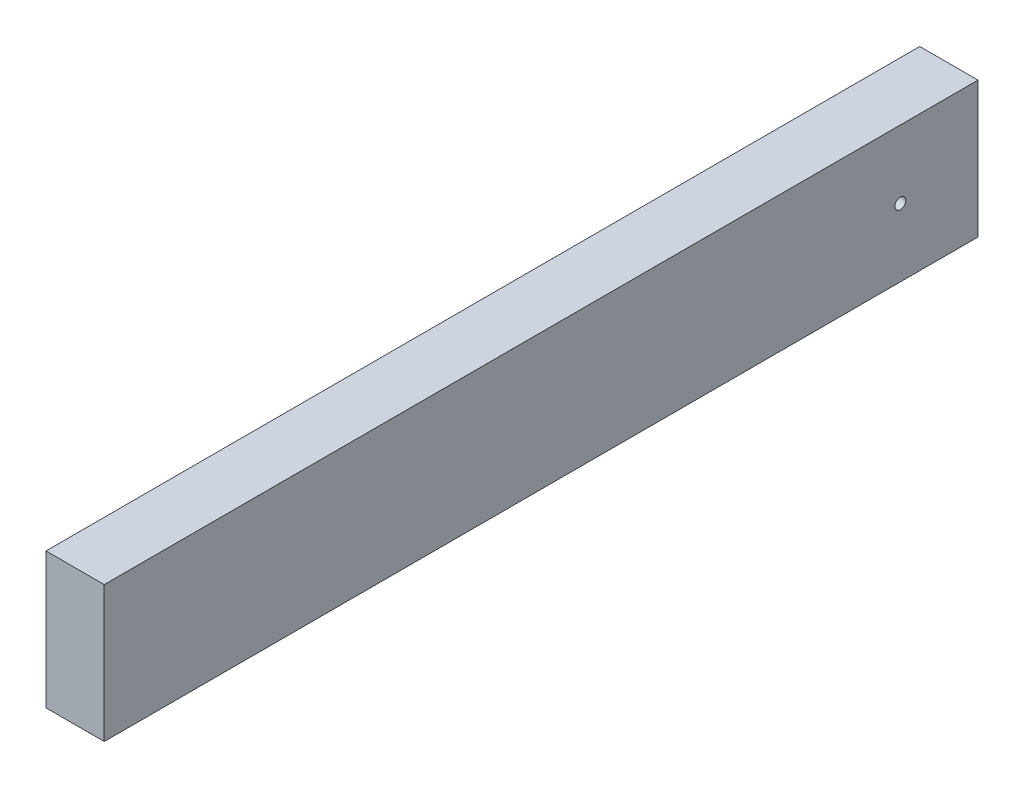
ISO-10303-21;
HEADER;
FILE_DESCRIPTION(('STEP AP214'),'2;1');
FILE_NAME('part.step','',(''),(''),'','','');
FILE_SCHEMA(('AUTOMOTIVE_DESIGN { 1 0 10303 214 1 1 1 1 }'));
ENDSEC;
DATA;
#1=APPLICATION_CONTEXT('core data for automotive mechanical design processes');
#2=APPLICATION_PROTOCOL_DEFINITION('international standard','automotive_design',2000,#1);
#3=PRODUCT_CONTEXT('',#1,'mechanical');
#4=PRODUCT('Part','Part','',(#3));
#5=PRODUCT_RELATED_PRODUCT_CATEGORY('part','',(#4));
#6=PRODUCT_DEFINITION_FORMATION('','',#4);
#7=PRODUCT_DEFINITION_CONTEXT('part definition',#1,'design');
#8=PRODUCT_DEFINITION('design','',#6,#7);
#9=PRODUCT_DEFINITION_SHAPE('','',#8);
#10=(LENGTH_UNIT() NAMED_UNIT(*) SI_UNIT(.MILLI.,.METRE.));
#11=(NAMED_UNIT(*) PLANE_ANGLE_UNIT() SI_UNIT($,.RADIAN.));
#12=(NAMED_UNIT(*) SI_UNIT($,.STERADIAN.) SOLID_ANGLE_UNIT());
#13=UNCERTAINTY_MEASURE_WITH_UNIT(LENGTH_MEASURE(1.E-05),#10,'distance_accuracy_value','');
#14=(GEOMETRIC_REPRESENTATION_CONTEXT(3) GLOBAL_UNCERTAINTY_ASSIGNED_CONTEXT((#13)) GLOBAL_UNIT_ASSIGNED_CONTEXT((#10,
#11,#12)) REPRESENTATION_CONTEXT('',''));
#15=CARTESIAN_POINT('',(0.,0.,0.));
#16=DIRECTION('',(0.,0.,1.));
#17=DIRECTION('',(1.,0.,0.));
#18=AXIS2_PLACEMENT_3D('',#15,#16,#17);
#19=CARTESIAN_POINT('',(19.05,-44.45,571.5));
#20=DIRECTION('',(-1.,0.,0.));
#21=DIRECTION('',(0.,0.,1.));
#22=AXIS2_PLACEMENT_3D('',#19,#20,#21);
#23=PLANE('',#22);
#24=CARTESIAN_POINT('',(19.05,0.,50.8));
#25=DIRECTION('',(1.,0.,0.));
#26=DIRECTION('',(0.,0.,-1.));
#27=AXIS2_PLACEMENT_3D('',#24,#25,#26);
#28=CIRCLE('',#27,3.571875);
#29=CARTESIAN_POINT('',(19.05,0.,47.228125));
#30=VERTEX_POINT('',#29);
#31=EDGE_CURVE('E131',#30,#30,#28,.T.);
#32=ORIENTED_EDGE('',*,*,#31,.F.);
#33=EDGE_LOOP('',(#32));
#34=FACE_BOUND('',#33,.T.);
#35=DIRECTION('',(0.,1.,0.));
#36=VECTOR('',#35,1.);
#37=CARTESIAN_POINT('',(19.05,-44.45,0.));
#38=LINE('',#37,#36);
#39=CARTESIAN_POINT('',(19.05,-44.45,0.));
#40=VERTEX_POINT('',#39);
#41=CARTESIAN_POINT('',(19.05,44.45,0.));
#42=VERTEX_POINT('',#41);
#43=EDGE_CURVE('E105',#40,#42,#38,.T.);
#44=ORIENTED_EDGE('',*,*,#43,.T.);
#45=DIRECTION('',(0.,0.,-1.));
#46=VECTOR('',#45,1.);
#47=CARTESIAN_POINT('',(19.05,44.45,571.5));
#48=LINE('',#47,#46);
#49=CARTESIAN_POINT('',(19.05,44.45,571.5));
#50=VERTEX_POINT('',#49);
#51=EDGE_CURVE('E11',#50,#42,#48,.T.);
#52=ORIENTED_EDGE('',*,*,#51,.F.);
#53=DIRECTION('',(0.,1.,0.));
#54=VECTOR('',#53,1.);
#55=CARTESIAN_POINT('',(19.05,-44.45,571.5));
#56=LINE('',#55,#54);
#57=CARTESIAN_POINT('',(19.05,-44.45,571.5));
#58=VERTEX_POINT('',#57);
#59=EDGE_CURVE('E88',#58,#50,#56,.T.);
#60=ORIENTED_EDGE('',*,*,#59,.F.);
#61=DIRECTION('',(0.,0.,-1.));
#62=VECTOR('',#61,1.);
#63=CARTESIAN_POINT('',(19.05,-44.45,571.5));
#64=LINE('',#63,#62);
#65=EDGE_CURVE('E101',#58,#40,#64,.T.);
#66=ORIENTED_EDGE('',*,*,#65,.T.);
#67=EDGE_LOOP('',(#44,#52,#60,#66));
#68=FACE_BOUND('',#67,.T.);
#69=ADVANCED_FACE('F36',(#34,#68),#23,.F.);
#70=CARTESIAN_POINT('',(-19.05,44.45,571.5));
#71=DIRECTION('',(0.,-1.,0.));
#72=DIRECTION('',(0.,0.,-1.));
#73=AXIS2_PLACEMENT_3D('',#70,#71,#72);
#74=PLANE('',#73);
#75=DIRECTION('',(-1.,0.,0.));
#76=VECTOR('',#75,1.);
#77=CARTESIAN_POINT('',(-19.05,44.45,0.));
#78=LINE('',#77,#76);
#79=CARTESIAN_POINT('',(-19.05,44.45,0.));
#80=VERTEX_POINT('',#79);
#81=EDGE_CURVE('E93',#42,#80,#78,.T.);
#82=ORIENTED_EDGE('',*,*,#81,.T.);
#83=DIRECTION('',(0.,0.,-1.));
#84=VECTOR('',#83,1.);
#85=CARTESIAN_POINT('',(-19.05,44.45,571.5));
#86=LINE('',#85,#84);
#87=CARTESIAN_POINT('',(-19.05,44.45,571.5));
#88=VERTEX_POINT('',#87);
#89=EDGE_CURVE('E45',#88,#80,#86,.T.);
#90=ORIENTED_EDGE('',*,*,#89,.F.);
#91=DIRECTION('',(-1.,0.,0.));
#92=VECTOR('',#91,1.);
#93=CARTESIAN_POINT('',(-19.05,44.45,571.5));
#94=LINE('',#93,#92);
#95=EDGE_CURVE('E83',#50,#88,#94,.T.);
#96=ORIENTED_EDGE('',*,*,#95,.F.);
#97=ORIENTED_EDGE('',*,*,#51,.T.);
#98=EDGE_LOOP('',(#82,#90,#96,#97));
#99=FACE_BOUND('',#98,.T.);
#100=ADVANCED_FACE('F92',(#99),#74,.F.);
#101=CARTESIAN_POINT('',(-19.05,-44.45,571.5));
#102=DIRECTION('',(1.,0.,0.));
#103=DIRECTION('',(0.,0.,-1.));
#104=AXIS2_PLACEMENT_3D('',#101,#102,#103);
#105=PLANE('',#104);
#106=CARTESIAN_POINT('',(-19.05,0.,50.8));
#107=DIRECTION('',(1.,0.,0.));
#108=DIRECTION('',(0.,0.,-1.));
#109=AXIS2_PLACEMENT_3D('',#106,#107,#108);
#110=CIRCLE('',#109,3.57187499999999);
#111=CARTESIAN_POINT('',(-19.05,0.,47.228125));
#112=VERTEX_POINT('',#111);
#113=EDGE_CURVE('E109',#112,#112,#110,.T.);
#114=ORIENTED_EDGE('',*,*,#113,.T.);
#115=EDGE_LOOP('',(#114));
#116=FACE_BOUND('',#115,.T.);
#117=DIRECTION('',(0.,-1.,0.));
#118=VECTOR('',#117,1.);
#119=CARTESIAN_POINT('',(-19.05,-44.45,0.));
#120=LINE('',#119,#118);
#121=CARTESIAN_POINT('',(-19.05,-44.45,0.));
#122=VERTEX_POINT('',#121);
#123=EDGE_CURVE('E70',#80,#122,#120,.T.);
#124=ORIENTED_EDGE('',*,*,#123,.T.);
#125=DIRECTION('',(0.,0.,-1.));
#126=VECTOR('',#125,1.);
#127=CARTESIAN_POINT('',(-19.05,-44.45,571.5));
#128=LINE('',#127,#126);
#129=CARTESIAN_POINT('',(-19.05,-44.45,571.5));
#130=VERTEX_POINT('',#129);
#131=EDGE_CURVE('E95',#130,#122,#128,.T.);
#132=ORIENTED_EDGE('',*,*,#131,.F.);
#133=DIRECTION('',(0.,-1.,0.));
#134=VECTOR('',#133,1.);
#135=CARTESIAN_POINT('',(-19.05,-44.45,571.5));
#136=LINE('',#135,#134);
#137=EDGE_CURVE('E86',#88,#130,#136,.T.);
#138=ORIENTED_EDGE('',*,*,#137,.F.);
#139=ORIENTED_EDGE('',*,*,#89,.T.);
#140=EDGE_LOOP('',(#124,#132,#138,#139));
#141=FACE_BOUND('',#140,.T.);
#142=ADVANCED_FACE('F96',(#116,#141),#105,.F.);
#143=CARTESIAN_POINT('',(-19.05,-44.45,571.5));
#144=DIRECTION('',(0.,1.,0.));
#145=DIRECTION('',(0.,0.,1.));
#146=AXIS2_PLACEMENT_3D('',#143,#144,#145);
#147=PLANE('',#146);
#148=DIRECTION('',(1.,0.,0.));
#149=VECTOR('',#148,1.);
#150=CARTESIAN_POINT('',(-19.05,-44.45,0.));
#151=LINE('',#150,#149);
#152=EDGE_CURVE('E76',#122,#40,#151,.T.);
#153=ORIENTED_EDGE('',*,*,#152,.T.);
#154=ORIENTED_EDGE('',*,*,#65,.F.);
#155=DIRECTION('',(1.,0.,0.));
#156=VECTOR('',#155,1.);
#157=CARTESIAN_POINT('',(-19.05,-44.45,571.5));
#158=LINE('',#157,#156);
#159=EDGE_CURVE('E53',#130,#58,#158,.T.);
#160=ORIENTED_EDGE('',*,*,#159,.F.);
#161=ORIENTED_EDGE('',*,*,#131,.T.);
#162=EDGE_LOOP('',(#153,#154,#160,#161));
#163=FACE_BOUND('',#162,.T.);
#164=ADVANCED_FACE('F120',(#163),#147,.F.);
#165=CARTESIAN_POINT('',(0.,0.,571.5));
#166=DIRECTION('',(0.,0.,-1.));
#167=DIRECTION('',(-1.,0.,0.));
#168=AXIS2_PLACEMENT_3D('',#165,#166,#167);
#169=PLANE('',#168);
#170=ORIENTED_EDGE('',*,*,#59,.T.);
#171=ORIENTED_EDGE('',*,*,#95,.T.);
#172=ORIENTED_EDGE('',*,*,#137,.T.);
#173=ORIENTED_EDGE('',*,*,#159,.T.);
#174=EDGE_LOOP('',(#170,#171,#172,#173));
#175=FACE_BOUND('',#174,.T.);
#176=ADVANCED_FACE('F84',(#175),#169,.F.);
#177=CARTESIAN_POINT('',(0.,0.,0.));
#178=DIRECTION('',(0.,0.,-1.));
#179=DIRECTION('',(-1.,0.,0.));
#180=AXIS2_PLACEMENT_3D('',#177,#178,#179);
#181=PLANE('',#180);
#182=ORIENTED_EDGE('',*,*,#43,.F.);
#183=ORIENTED_EDGE('',*,*,#152,.F.);
#184=ORIENTED_EDGE('',*,*,#123,.F.);
#185=ORIENTED_EDGE('',*,*,#81,.F.);
#186=EDGE_LOOP('',(#182,#183,#184,#185));
#187=FACE_BOUND('',#186,.T.);
#188=ADVANCED_FACE('F123',(#187),#181,.T.);
#189=CARTESIAN_POINT('',(19.05,0.,50.8));
#190=DIRECTION('',(1.,0.,0.));
#191=DIRECTION('',(0.,0.,-1.));
#192=AXIS2_PLACEMENT_3D('',#189,#190,#191);
#193=CYLINDRICAL_SURFACE('',#192,3.57187499999999);
#194=ORIENTED_EDGE('',*,*,#113,.F.);
#195=EDGE_LOOP('',(#194));
#196=FACE_BOUND('',#195,.T.);
#197=ORIENTED_EDGE('',*,*,#31,.T.);
#198=EDGE_LOOP('',(#197));
#199=FACE_BOUND('',#198,.T.);
#200=ADVANCED_FACE('F137',(#196,#199),#193,.F.);
#201=CLOSED_SHELL('',(#69,#100,#142,#164,#176,#188,#200));
#202=MANIFOLD_SOLID_BREP('B2',#201);
#203=ADVANCED_BREP_SHAPE_REPRESENTATION('',(#18,#202),#14);
#204=SHAPE_DEFINITION_REPRESENTATION(#9,#203);
ENDSEC;
END-ISO-10303-21;
